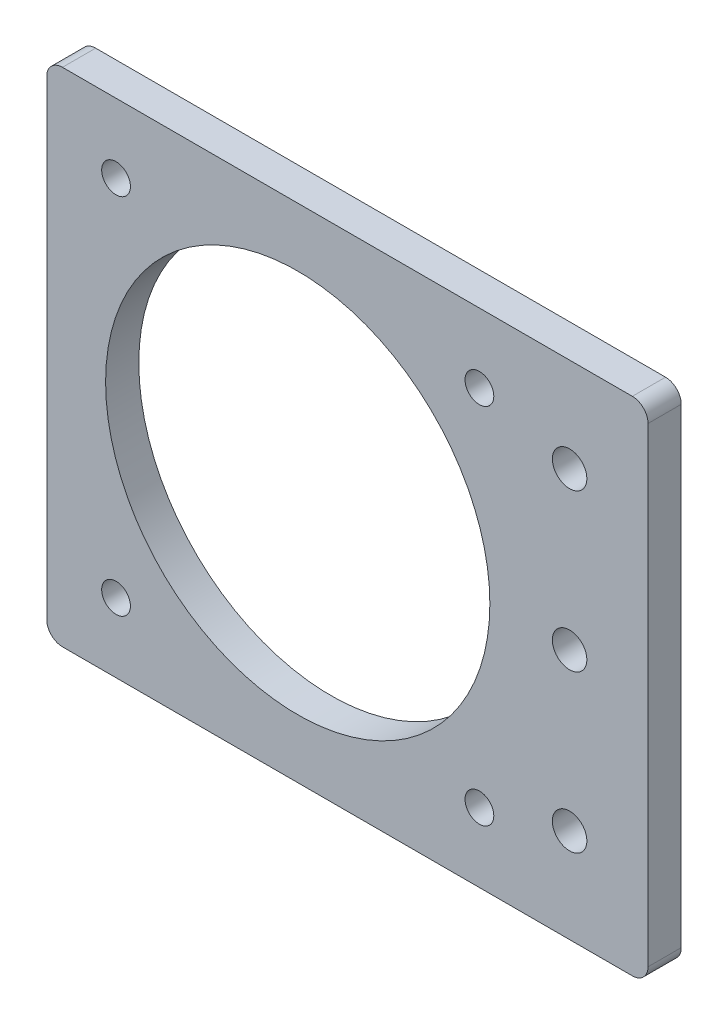
ISO-10303-21;
HEADER;
FILE_DESCRIPTION(('STEP AP214'),'2;1');
FILE_NAME('part.step','',(''),(''),'','','');
FILE_SCHEMA(('AUTOMOTIVE_DESIGN { 1 0 10303 214 1 1 1 1 }'));
ENDSEC;
DATA;
#1=APPLICATION_CONTEXT('core data for automotive mechanical design processes');
#2=APPLICATION_PROTOCOL_DEFINITION('international standard','automotive_design',2000,#1);
#3=PRODUCT_CONTEXT('',#1,'mechanical');
#4=PRODUCT('Part','Part','',(#3));
#5=PRODUCT_RELATED_PRODUCT_CATEGORY('part','',(#4));
#6=PRODUCT_DEFINITION_FORMATION('','',#4);
#7=PRODUCT_DEFINITION_CONTEXT('part definition',#1,'design');
#8=PRODUCT_DEFINITION('design','',#6,#7);
#9=PRODUCT_DEFINITION_SHAPE('','',#8);
#10=(LENGTH_UNIT() NAMED_UNIT(*) SI_UNIT(.MILLI.,.METRE.));
#11=(NAMED_UNIT(*) PLANE_ANGLE_UNIT() SI_UNIT($,.RADIAN.));
#12=(NAMED_UNIT(*) SI_UNIT($,.STERADIAN.) SOLID_ANGLE_UNIT());
#13=UNCERTAINTY_MEASURE_WITH_UNIT(LENGTH_MEASURE(1.E-05),#10,'distance_accuracy_value','');
#14=(GEOMETRIC_REPRESENTATION_CONTEXT(3) GLOBAL_UNCERTAINTY_ASSIGNED_CONTEXT((#13)) GLOBAL_UNIT_ASSIGNED_CONTEXT((#10,
#11,#12)) REPRESENTATION_CONTEXT('',''));
#15=CARTESIAN_POINT('',(0.,0.,0.));
#16=DIRECTION('',(0.,0.,1.));
#17=DIRECTION('',(1.,0.,0.));
#18=AXIS2_PLACEMENT_3D('',#15,#16,#17);
#19=CARTESIAN_POINT('',(57.5,-48.,6.35));
#20=DIRECTION('',(-1.,0.,0.));
#21=DIRECTION('',(0.,0.,1.));
#22=AXIS2_PLACEMENT_3D('',#19,#20,#21);
#23=PLANE('',#22);
#24=DIRECTION('',(0.,1.,0.));
#25=VECTOR('',#24,1.);
#26=CARTESIAN_POINT('',(57.5,-48.,6.35));
#27=LINE('',#26,#25);
#28=CARTESIAN_POINT('',(57.5,-45.,6.35));
#29=VERTEX_POINT('',#28);
#30=CARTESIAN_POINT('',(57.5,45.,6.35));
#31=VERTEX_POINT('',#30);
#32=EDGE_CURVE('E121',#29,#31,#27,.T.);
#33=ORIENTED_EDGE('',*,*,#32,.F.);
#34=DIRECTION('',(0.,0.,-1.));
#35=VECTOR('',#34,1.);
#36=CARTESIAN_POINT('',(57.5,-45.,6.35));
#37=LINE('',#36,#35);
#38=CARTESIAN_POINT('',(57.5,-45.,0.));
#39=VERTEX_POINT('',#38);
#40=EDGE_CURVE('E106',#29,#39,#37,.T.);
#41=ORIENTED_EDGE('',*,*,#40,.T.);
#42=DIRECTION('',(0.,1.,0.));
#43=VECTOR('',#42,1.);
#44=CARTESIAN_POINT('',(57.5,-48.,0.));
#45=LINE('',#44,#43);
#46=CARTESIAN_POINT('',(57.5,45.,0.));
#47=VERTEX_POINT('',#46);
#48=EDGE_CURVE('E118',#39,#47,#45,.T.);
#49=ORIENTED_EDGE('',*,*,#48,.T.);
#50=DIRECTION('',(0.,0.,-1.));
#51=VECTOR('',#50,1.);
#52=CARTESIAN_POINT('',(57.5,45.,6.35));
#53=LINE('',#52,#51);
#54=EDGE_CURVE('E123',#47,#31,#53,.F.);
#55=ORIENTED_EDGE('',*,*,#54,.T.);
#56=EDGE_LOOP('',(#33,#41,#49,#55));
#57=FACE_BOUND('',#56,.T.);
#58=ADVANCED_FACE('F33',(#57),#23,.F.);
#59=CARTESIAN_POINT('',(-57.5,48.,6.35));
#60=DIRECTION('',(0.,-1.,0.));
#61=DIRECTION('',(0.,0.,-1.));
#62=AXIS2_PLACEMENT_3D('',#59,#60,#61);
#63=PLANE('',#62);
#64=DIRECTION('',(-1.,0.,0.));
#65=VECTOR('',#64,1.);
#66=CARTESIAN_POINT('',(-57.5,48.,6.35));
#67=LINE('',#66,#65);
#68=CARTESIAN_POINT('',(54.5,48.,6.35));
#69=VERTEX_POINT('',#68);
#70=CARTESIAN_POINT('',(-54.5,48.,6.35));
#71=VERTEX_POINT('',#70);
#72=EDGE_CURVE('E185',#69,#71,#67,.T.);
#73=ORIENTED_EDGE('',*,*,#72,.F.);
#74=DIRECTION('',(0.,0.,-1.));
#75=VECTOR('',#74,1.);
#76=CARTESIAN_POINT('',(54.5,48.,6.35));
#77=LINE('',#76,#75);
#78=CARTESIAN_POINT('',(54.5,48.,0.));
#79=VERTEX_POINT('',#78);
#80=EDGE_CURVE('E11',#69,#79,#77,.T.);
#81=ORIENTED_EDGE('',*,*,#80,.T.);
#82=DIRECTION('',(-1.,0.,0.));
#83=VECTOR('',#82,1.);
#84=CARTESIAN_POINT('',(-57.5,48.,0.));
#85=LINE('',#84,#83);
#86=CARTESIAN_POINT('',(-54.5,48.,0.));
#87=VERTEX_POINT('',#86);
#88=EDGE_CURVE('E128',#79,#87,#85,.T.);
#89=ORIENTED_EDGE('',*,*,#88,.T.);
#90=DIRECTION('',(0.,0.,-1.));
#91=VECTOR('',#90,1.);
#92=CARTESIAN_POINT('',(-54.5,48.,6.35));
#93=LINE('',#92,#91);
#94=EDGE_CURVE('E42',#87,#71,#93,.F.);
#95=ORIENTED_EDGE('',*,*,#94,.T.);
#96=EDGE_LOOP('',(#73,#81,#89,#95));
#97=FACE_BOUND('',#96,.T.);
#98=ADVANCED_FACE('F203',(#97),#63,.F.);
#99=CARTESIAN_POINT('',(-57.5,-48.,6.35));
#100=DIRECTION('',(1.,0.,0.));
#101=DIRECTION('',(0.,0.,-1.));
#102=AXIS2_PLACEMENT_3D('',#99,#100,#101);
#103=PLANE('',#102);
#104=DIRECTION('',(0.,-1.,0.));
#105=VECTOR('',#104,1.);
#106=CARTESIAN_POINT('',(-57.5,-48.,0.));
#107=LINE('',#106,#105);
#108=CARTESIAN_POINT('',(-57.5,45.,0.));
#109=VERTEX_POINT('',#108);
#110=CARTESIAN_POINT('',(-57.5,-45.,0.));
#111=VERTEX_POINT('',#110);
#112=EDGE_CURVE('E132',#109,#111,#107,.T.);
#113=ORIENTED_EDGE('',*,*,#112,.T.);
#114=DIRECTION('',(0.,0.,-1.));
#115=VECTOR('',#114,1.);
#116=CARTESIAN_POINT('',(-57.5,-45.,6.35));
#117=LINE('',#116,#115);
#118=CARTESIAN_POINT('',(-57.5,-45.,6.35));
#119=VERTEX_POINT('',#118);
#120=EDGE_CURVE('E50',#111,#119,#117,.F.);
#121=ORIENTED_EDGE('',*,*,#120,.T.);
#122=DIRECTION('',(0.,-1.,0.));
#123=VECTOR('',#122,1.);
#124=CARTESIAN_POINT('',(-57.5,-48.,6.35));
#125=LINE('',#124,#123);
#126=CARTESIAN_POINT('',(-57.5,45.,6.35));
#127=VERTEX_POINT('',#126);
#128=EDGE_CURVE('E186',#127,#119,#125,.T.);
#129=ORIENTED_EDGE('',*,*,#128,.F.);
#130=DIRECTION('',(0.,0.,-1.));
#131=VECTOR('',#130,1.);
#132=CARTESIAN_POINT('',(-57.5,45.,6.35));
#133=LINE('',#132,#131);
#134=EDGE_CURVE('E158',#127,#109,#133,.T.);
#135=ORIENTED_EDGE('',*,*,#134,.T.);
#136=EDGE_LOOP('',(#113,#121,#129,#135));
#137=FACE_BOUND('',#136,.T.);
#138=ADVANCED_FACE('F197',(#137),#103,.F.);
#139=CARTESIAN_POINT('',(-57.5,-48.,6.35));
#140=DIRECTION('',(0.,1.,0.));
#141=DIRECTION('',(0.,0.,1.));
#142=AXIS2_PLACEMENT_3D('',#139,#140,#141);
#143=PLANE('',#142);
#144=DIRECTION('',(1.,0.,0.));
#145=VECTOR('',#144,1.);
#146=CARTESIAN_POINT('',(-57.5,-48.,0.));
#147=LINE('',#146,#145);
#148=CARTESIAN_POINT('',(-54.5,-48.,0.));
#149=VERTEX_POINT('',#148);
#150=CARTESIAN_POINT('',(54.5,-48.,0.));
#151=VERTEX_POINT('',#150);
#152=EDGE_CURVE('E142',#149,#151,#147,.T.);
#153=ORIENTED_EDGE('',*,*,#152,.T.);
#154=DIRECTION('',(0.,0.,-1.));
#155=VECTOR('',#154,1.);
#156=CARTESIAN_POINT('',(54.5,-48.,6.35));
#157=LINE('',#156,#155);
#158=CARTESIAN_POINT('',(54.5,-48.,6.35));
#159=VERTEX_POINT('',#158);
#160=EDGE_CURVE('E107',#151,#159,#157,.F.);
#161=ORIENTED_EDGE('',*,*,#160,.T.);
#162=DIRECTION('',(1.,0.,0.));
#163=VECTOR('',#162,1.);
#164=CARTESIAN_POINT('',(-57.5,-48.,6.35));
#165=LINE('',#164,#163);
#166=CARTESIAN_POINT('',(-54.5,-48.,6.35));
#167=VERTEX_POINT('',#166);
#168=EDGE_CURVE('E138',#167,#159,#165,.T.);
#169=ORIENTED_EDGE('',*,*,#168,.F.);
#170=DIRECTION('',(0.,0.,-1.));
#171=VECTOR('',#170,1.);
#172=CARTESIAN_POINT('',(-54.5,-48.,6.35));
#173=LINE('',#172,#171);
#174=EDGE_CURVE('E112',#167,#149,#173,.T.);
#175=ORIENTED_EDGE('',*,*,#174,.T.);
#176=EDGE_LOOP('',(#153,#161,#169,#175));
#177=FACE_BOUND('',#176,.T.);
#178=ADVANCED_FACE('F193',(#177),#143,.F.);
#179=CARTESIAN_POINT('',(0.,0.,6.35));
#180=DIRECTION('',(0.,0.,-1.));
#181=DIRECTION('',(-1.,0.,0.));
#182=AXIS2_PLACEMENT_3D('',#179,#180,#181);
#183=PLANE('',#182);
#184=CARTESIAN_POINT('',(25.25,-34.75,6.35));
#185=DIRECTION('',(0.,0.,1.));
#186=DIRECTION('',(1.,0.,0.));
#187=AXIS2_PLACEMENT_3D('',#184,#185,#186);
#188=CIRCLE('',#187,2.75);
#189=CARTESIAN_POINT('',(28.,-34.75,6.35));
#190=VERTEX_POINT('',#189);
#191=EDGE_CURVE('E407',#190,#190,#188,.T.);
#192=ORIENTED_EDGE('',*,*,#191,.F.);
#193=EDGE_LOOP('',(#192));
#194=FACE_BOUND('',#193,.T.);
#195=CARTESIAN_POINT('',(-44.25,-34.75,6.35));
#196=DIRECTION('',(0.,0.,1.));
#197=DIRECTION('',(1.,0.,0.));
#198=AXIS2_PLACEMENT_3D('',#195,#196,#197);
#199=CIRCLE('',#198,2.75);
#200=CARTESIAN_POINT('',(-41.5,-34.75,6.35));
#201=VERTEX_POINT('',#200);
#202=EDGE_CURVE('E401',#201,#201,#199,.T.);
#203=ORIENTED_EDGE('',*,*,#202,.F.);
#204=EDGE_LOOP('',(#203));
#205=FACE_BOUND('',#204,.T.);
#206=CARTESIAN_POINT('',(-44.25,34.75,6.35));
#207=DIRECTION('',(0.,0.,1.));
#208=DIRECTION('',(1.,0.,0.));
#209=AXIS2_PLACEMENT_3D('',#206,#207,#208);
#210=CIRCLE('',#209,2.75);
#211=CARTESIAN_POINT('',(-41.5,34.75,6.35));
#212=VERTEX_POINT('',#211);
#213=EDGE_CURVE('E395',#212,#212,#210,.T.);
#214=ORIENTED_EDGE('',*,*,#213,.F.);
#215=EDGE_LOOP('',(#214));
#216=FACE_BOUND('',#215,.T.);
#217=CARTESIAN_POINT('',(25.25,34.75,6.35));
#218=DIRECTION('',(0.,0.,1.));
#219=DIRECTION('',(1.,0.,0.));
#220=AXIS2_PLACEMENT_3D('',#217,#218,#219);
#221=CIRCLE('',#220,2.75);
#222=CARTESIAN_POINT('',(28.,34.75,6.35));
#223=VERTEX_POINT('',#222);
#224=EDGE_CURVE('E386',#223,#223,#221,.T.);
#225=ORIENTED_EDGE('',*,*,#224,.F.);
#226=EDGE_LOOP('',(#225));
#227=FACE_BOUND('',#226,.T.);
#228=CARTESIAN_POINT('',(42.5,30.,6.35));
#229=DIRECTION('',(0.,0.,1.));
#230=DIRECTION('',(1.,0.,0.));
#231=AXIS2_PLACEMENT_3D('',#228,#229,#230);
#232=CIRCLE('',#231,3.3);
#233=CARTESIAN_POINT('',(45.8,30.,6.35));
#234=VERTEX_POINT('',#233);
#235=EDGE_CURVE('E178',#234,#234,#232,.T.);
#236=ORIENTED_EDGE('',*,*,#235,.F.);
#237=EDGE_LOOP('',(#236));
#238=FACE_BOUND('',#237,.T.);
#239=CARTESIAN_POINT('',(42.5,0.,6.35));
#240=DIRECTION('',(0.,0.,1.));
#241=DIRECTION('',(1.,0.,0.));
#242=AXIS2_PLACEMENT_3D('',#239,#240,#241);
#243=CIRCLE('',#242,3.3);
#244=CARTESIAN_POINT('',(45.8,0.,6.35));
#245=VERTEX_POINT('',#244);
#246=EDGE_CURVE('E168',#245,#245,#243,.T.);
#247=ORIENTED_EDGE('',*,*,#246,.F.);
#248=EDGE_LOOP('',(#247));
#249=FACE_BOUND('',#248,.T.);
#250=CARTESIAN_POINT('',(42.5,-30.,6.35));
#251=DIRECTION('',(0.,0.,1.));
#252=DIRECTION('',(1.,0.,0.));
#253=AXIS2_PLACEMENT_3D('',#250,#251,#252);
#254=CIRCLE('',#253,3.3);
#255=CARTESIAN_POINT('',(45.8,-30.,6.35));
#256=VERTEX_POINT('',#255);
#257=EDGE_CURVE('E165',#256,#256,#254,.T.);
#258=ORIENTED_EDGE('',*,*,#257,.F.);
#259=EDGE_LOOP('',(#258));
#260=FACE_BOUND('',#259,.T.);
#261=CARTESIAN_POINT('',(-9.5,0.,6.35));
#262=DIRECTION('',(0.,0.,1.));
#263=DIRECTION('',(1.,0.,0.));
#264=AXIS2_PLACEMENT_3D('',#261,#262,#263);
#265=CIRCLE('',#264,36.75);
#266=CARTESIAN_POINT('',(27.25,0.,6.35));
#267=VERTEX_POINT('',#266);
#268=EDGE_CURVE('E135',#267,#267,#265,.T.);
#269=ORIENTED_EDGE('',*,*,#268,.F.);
#270=EDGE_LOOP('',(#269));
#271=FACE_BOUND('',#270,.T.);
#272=ORIENTED_EDGE('',*,*,#168,.T.);
#273=CARTESIAN_POINT('',(54.5,-45.,6.35));
#274=DIRECTION('',(0.,0.,-1.));
#275=DIRECTION('',(-1.,0.,0.));
#276=AXIS2_PLACEMENT_3D('',#273,#274,#275);
#277=CIRCLE('',#276,3.);
#278=EDGE_CURVE('E156',#159,#29,#277,.F.);
#279=ORIENTED_EDGE('',*,*,#278,.T.);
#280=ORIENTED_EDGE('',*,*,#32,.T.);
#281=CARTESIAN_POINT('',(54.5,45.,6.35));
#282=DIRECTION('',(0.,0.,-1.));
#283=DIRECTION('',(-1.,0.,0.));
#284=AXIS2_PLACEMENT_3D('',#281,#282,#283);
#285=CIRCLE('',#284,3.);
#286=EDGE_CURVE('E152',#31,#69,#285,.F.);
#287=ORIENTED_EDGE('',*,*,#286,.T.);
#288=ORIENTED_EDGE('',*,*,#72,.T.);
#289=CARTESIAN_POINT('',(-54.5,45.,6.35));
#290=DIRECTION('',(0.,0.,-1.));
#291=DIRECTION('',(-1.,0.,0.));
#292=AXIS2_PLACEMENT_3D('',#289,#290,#291);
#293=CIRCLE('',#292,3.);
#294=EDGE_CURVE('E57',#71,#127,#293,.F.);
#295=ORIENTED_EDGE('',*,*,#294,.T.);
#296=ORIENTED_EDGE('',*,*,#128,.T.);
#297=CARTESIAN_POINT('',(-54.5,-45.,6.35));
#298=DIRECTION('',(0.,0.,-1.));
#299=DIRECTION('',(-1.,0.,0.));
#300=AXIS2_PLACEMENT_3D('',#297,#298,#299);
#301=CIRCLE('',#300,3.);
#302=EDGE_CURVE('E154',#119,#167,#301,.F.);
#303=ORIENTED_EDGE('',*,*,#302,.T.);
#304=EDGE_LOOP('',(#272,#279,#280,#287,#288,#295,#296,#303));
#305=FACE_BOUND('',#304,.T.);
#306=ADVANCED_FACE('F190',(#194,#205,#216,#227,#238,#249,#260,#271,#305),#183,.F.);
#307=CARTESIAN_POINT('',(0.,0.,0.));
#308=DIRECTION('',(0.,0.,-1.));
#309=DIRECTION('',(-1.,0.,0.));
#310=AXIS2_PLACEMENT_3D('',#307,#308,#309);
#311=PLANE('',#310);
#312=CARTESIAN_POINT('',(25.25,-34.75,0.));
#313=DIRECTION('',(0.,0.,1.));
#314=DIRECTION('',(1.,0.,0.));
#315=AXIS2_PLACEMENT_3D('',#312,#313,#314);
#316=CIRCLE('',#315,2.75);
#317=CARTESIAN_POINT('',(28.,-34.75,0.));
#318=VERTEX_POINT('',#317);
#319=EDGE_CURVE('E404',#318,#318,#316,.T.);
#320=ORIENTED_EDGE('',*,*,#319,.T.);
#321=EDGE_LOOP('',(#320));
#322=FACE_BOUND('',#321,.T.);
#323=CARTESIAN_POINT('',(-44.25,-34.75,0.));
#324=DIRECTION('',(0.,0.,1.));
#325=DIRECTION('',(1.,0.,0.));
#326=AXIS2_PLACEMENT_3D('',#323,#324,#325);
#327=CIRCLE('',#326,2.75);
#328=CARTESIAN_POINT('',(-41.5,-34.75,0.));
#329=VERTEX_POINT('',#328);
#330=EDGE_CURVE('E398',#329,#329,#327,.T.);
#331=ORIENTED_EDGE('',*,*,#330,.T.);
#332=EDGE_LOOP('',(#331));
#333=FACE_BOUND('',#332,.T.);
#334=CARTESIAN_POINT('',(-44.25,34.75,0.));
#335=DIRECTION('',(0.,0.,1.));
#336=DIRECTION('',(1.,0.,0.));
#337=AXIS2_PLACEMENT_3D('',#334,#335,#336);
#338=CIRCLE('',#337,2.75);
#339=CARTESIAN_POINT('',(-41.5,34.75,0.));
#340=VERTEX_POINT('',#339);
#341=EDGE_CURVE('E390',#340,#340,#338,.T.);
#342=ORIENTED_EDGE('',*,*,#341,.T.);
#343=EDGE_LOOP('',(#342));
#344=FACE_BOUND('',#343,.T.);
#345=CARTESIAN_POINT('',(25.25,34.75,0.));
#346=DIRECTION('',(0.,0.,1.));
#347=DIRECTION('',(1.,0.,0.));
#348=AXIS2_PLACEMENT_3D('',#345,#346,#347);
#349=CIRCLE('',#348,2.75);
#350=CARTESIAN_POINT('',(28.,34.75,0.));
#351=VERTEX_POINT('',#350);
#352=EDGE_CURVE('E384',#351,#351,#349,.T.);
#353=ORIENTED_EDGE('',*,*,#352,.T.);
#354=EDGE_LOOP('',(#353));
#355=FACE_BOUND('',#354,.T.);
#356=CARTESIAN_POINT('',(42.5,30.,0.));
#357=DIRECTION('',(0.,0.,-1.));
#358=DIRECTION('',(-1.,0.,0.));
#359=AXIS2_PLACEMENT_3D('',#356,#357,#358);
#360=CIRCLE('',#359,3.3);
#361=CARTESIAN_POINT('',(39.2,30.,0.));
#362=VERTEX_POINT('',#361);
#363=EDGE_CURVE('E37',#362,#362,#360,.T.);
#364=ORIENTED_EDGE('',*,*,#363,.F.);
#365=EDGE_LOOP('',(#364));
#366=FACE_BOUND('',#365,.T.);
#367=CARTESIAN_POINT('',(42.5,0.,0.));
#368=DIRECTION('',(0.,0.,-1.));
#369=DIRECTION('',(-1.,0.,0.));
#370=AXIS2_PLACEMENT_3D('',#367,#368,#369);
#371=CIRCLE('',#370,3.3);
#372=CARTESIAN_POINT('',(39.2,0.,0.));
#373=VERTEX_POINT('',#372);
#374=EDGE_CURVE('E166',#373,#373,#371,.T.);
#375=ORIENTED_EDGE('',*,*,#374,.F.);
#376=EDGE_LOOP('',(#375));
#377=FACE_BOUND('',#376,.T.);
#378=CARTESIAN_POINT('',(42.5,-30.,0.));
#379=DIRECTION('',(0.,0.,-1.));
#380=DIRECTION('',(-1.,0.,0.));
#381=AXIS2_PLACEMENT_3D('',#378,#379,#380);
#382=CIRCLE('',#381,3.3);
#383=CARTESIAN_POINT('',(39.2,-30.,0.));
#384=VERTEX_POINT('',#383);
#385=EDGE_CURVE('E163',#384,#384,#382,.T.);
#386=ORIENTED_EDGE('',*,*,#385,.F.);
#387=EDGE_LOOP('',(#386));
#388=FACE_BOUND('',#387,.T.);
#389=CARTESIAN_POINT('',(-9.5,0.,0.));
#390=DIRECTION('',(0.,0.,1.));
#391=DIRECTION('',(1.,0.,0.));
#392=AXIS2_PLACEMENT_3D('',#389,#390,#391);
#393=CIRCLE('',#392,36.75);
#394=CARTESIAN_POINT('',(27.25,0.,0.));
#395=VERTEX_POINT('',#394);
#396=EDGE_CURVE('E129',#395,#395,#393,.T.);
#397=ORIENTED_EDGE('',*,*,#396,.T.);
#398=EDGE_LOOP('',(#397));
#399=FACE_BOUND('',#398,.T.);
#400=ORIENTED_EDGE('',*,*,#48,.F.);
#401=CARTESIAN_POINT('',(54.5,-45.,0.));
#402=DIRECTION('',(0.,0.,-1.));
#403=DIRECTION('',(-1.,0.,0.));
#404=AXIS2_PLACEMENT_3D('',#401,#402,#403);
#405=CIRCLE('',#404,3.);
#406=EDGE_CURVE('E102',#39,#151,#405,.T.);
#407=ORIENTED_EDGE('',*,*,#406,.T.);
#408=ORIENTED_EDGE('',*,*,#152,.F.);
#409=CARTESIAN_POINT('',(-54.5,-45.,0.));
#410=DIRECTION('',(0.,0.,-1.));
#411=DIRECTION('',(-1.,0.,0.));
#412=AXIS2_PLACEMENT_3D('',#409,#410,#411);
#413=CIRCLE('',#412,3.);
#414=EDGE_CURVE('E113',#149,#111,#413,.T.);
#415=ORIENTED_EDGE('',*,*,#414,.T.);
#416=ORIENTED_EDGE('',*,*,#112,.F.);
#417=CARTESIAN_POINT('',(-54.5,45.,0.));
#418=DIRECTION('',(0.,0.,-1.));
#419=DIRECTION('',(-1.,0.,0.));
#420=AXIS2_PLACEMENT_3D('',#417,#418,#419);
#421=CIRCLE('',#420,3.);
#422=EDGE_CURVE('E122',#109,#87,#421,.T.);
#423=ORIENTED_EDGE('',*,*,#422,.T.);
#424=ORIENTED_EDGE('',*,*,#88,.F.);
#425=CARTESIAN_POINT('',(54.5,45.,0.));
#426=DIRECTION('',(0.,0.,-1.));
#427=DIRECTION('',(-1.,0.,0.));
#428=AXIS2_PLACEMENT_3D('',#425,#426,#427);
#429=CIRCLE('',#428,3.);
#430=EDGE_CURVE('E127',#79,#47,#429,.T.);
#431=ORIENTED_EDGE('',*,*,#430,.T.);
#432=EDGE_LOOP('',(#400,#407,#408,#415,#416,#423,#424,#431));
#433=FACE_BOUND('',#432,.T.);
#434=ADVANCED_FACE('F125',(#322,#333,#344,#355,#366,#377,#388,#399,#433),#311,.T.);
#435=CARTESIAN_POINT('',(-9.5,0.,0.));
#436=DIRECTION('',(0.,0.,1.));
#437=DIRECTION('',(1.,0.,0.));
#438=AXIS2_PLACEMENT_3D('',#435,#436,#437);
#439=CYLINDRICAL_SURFACE('',#438,36.75);
#440=ORIENTED_EDGE('',*,*,#396,.F.);
#441=EDGE_LOOP('',(#440));
#442=FACE_BOUND('',#441,.T.);
#443=ORIENTED_EDGE('',*,*,#268,.T.);
#444=EDGE_LOOP('',(#443));
#445=FACE_BOUND('',#444,.T.);
#446=ADVANCED_FACE('F224',(#442,#445),#439,.F.);
#447=CARTESIAN_POINT('',(54.5,-45.,6.35));
#448=DIRECTION('',(0.,0.,-1.));
#449=DIRECTION('',(-1.,0.,0.));
#450=AXIS2_PLACEMENT_3D('',#447,#448,#449);
#451=CYLINDRICAL_SURFACE('',#450,3.);
#452=ORIENTED_EDGE('',*,*,#278,.F.);
#453=ORIENTED_EDGE('',*,*,#160,.F.);
#454=ORIENTED_EDGE('',*,*,#406,.F.);
#455=ORIENTED_EDGE('',*,*,#40,.F.);
#456=EDGE_LOOP('',(#452,#453,#454,#455));
#457=FACE_BOUND('',#456,.T.);
#458=ADVANCED_FACE('F105',(#457),#451,.T.);
#459=CARTESIAN_POINT('',(-54.5,-45.,6.35));
#460=DIRECTION('',(0.,0.,-1.));
#461=DIRECTION('',(-1.,0.,0.));
#462=AXIS2_PLACEMENT_3D('',#459,#460,#461);
#463=CYLINDRICAL_SURFACE('',#462,3.);
#464=ORIENTED_EDGE('',*,*,#302,.F.);
#465=ORIENTED_EDGE('',*,*,#120,.F.);
#466=ORIENTED_EDGE('',*,*,#414,.F.);
#467=ORIENTED_EDGE('',*,*,#174,.F.);
#468=EDGE_LOOP('',(#464,#465,#466,#467));
#469=FACE_BOUND('',#468,.T.);
#470=ADVANCED_FACE('F195',(#469),#463,.T.);
#471=CARTESIAN_POINT('',(54.5,45.,6.35));
#472=DIRECTION('',(0.,0.,-1.));
#473=DIRECTION('',(-1.,0.,0.));
#474=AXIS2_PLACEMENT_3D('',#471,#472,#473);
#475=CYLINDRICAL_SURFACE('',#474,3.);
#476=ORIENTED_EDGE('',*,*,#286,.F.);
#477=ORIENTED_EDGE('',*,*,#54,.F.);
#478=ORIENTED_EDGE('',*,*,#430,.F.);
#479=ORIENTED_EDGE('',*,*,#80,.F.);
#480=EDGE_LOOP('',(#476,#477,#478,#479));
#481=FACE_BOUND('',#480,.T.);
#482=ADVANCED_FACE('F207',(#481),#475,.T.);
#483=CARTESIAN_POINT('',(-54.5,45.,6.35));
#484=DIRECTION('',(0.,0.,-1.));
#485=DIRECTION('',(-1.,0.,0.));
#486=AXIS2_PLACEMENT_3D('',#483,#484,#485);
#487=CYLINDRICAL_SURFACE('',#486,3.);
#488=ORIENTED_EDGE('',*,*,#294,.F.);
#489=ORIENTED_EDGE('',*,*,#94,.F.);
#490=ORIENTED_EDGE('',*,*,#422,.F.);
#491=ORIENTED_EDGE('',*,*,#134,.F.);
#492=EDGE_LOOP('',(#488,#489,#490,#491));
#493=FACE_BOUND('',#492,.T.);
#494=ADVANCED_FACE('F35',(#493),#487,.T.);
#495=CARTESIAN_POINT('',(42.5,-30.,6.35));
#496=DIRECTION('',(0.,0.,1.));
#497=DIRECTION('',(1.,0.,0.));
#498=AXIS2_PLACEMENT_3D('',#495,#496,#497);
#499=CYLINDRICAL_SURFACE('',#498,3.3);
#500=ORIENTED_EDGE('',*,*,#385,.T.);
#501=EDGE_LOOP('',(#500));
#502=FACE_BOUND('',#501,.T.);
#503=ORIENTED_EDGE('',*,*,#257,.T.);
#504=EDGE_LOOP('',(#503));
#505=FACE_BOUND('',#504,.T.);
#506=ADVANCED_FACE('F213',(#502,#505),#499,.F.);
#507=CARTESIAN_POINT('',(42.5,0.,6.35));
#508=DIRECTION('',(0.,0.,1.));
#509=DIRECTION('',(1.,0.,0.));
#510=AXIS2_PLACEMENT_3D('',#507,#508,#509);
#511=CYLINDRICAL_SURFACE('',#510,3.3);
#512=ORIENTED_EDGE('',*,*,#374,.T.);
#513=EDGE_LOOP('',(#512));
#514=FACE_BOUND('',#513,.T.);
#515=ORIENTED_EDGE('',*,*,#246,.T.);
#516=EDGE_LOOP('',(#515));
#517=FACE_BOUND('',#516,.T.);
#518=ADVANCED_FACE('F313',(#514,#517),#511,.F.);
#519=CARTESIAN_POINT('',(42.5,30.,6.35));
#520=DIRECTION('',(0.,0.,1.));
#521=DIRECTION('',(1.,0.,0.));
#522=AXIS2_PLACEMENT_3D('',#519,#520,#521);
#523=CYLINDRICAL_SURFACE('',#522,3.3);
#524=ORIENTED_EDGE('',*,*,#363,.T.);
#525=EDGE_LOOP('',(#524));
#526=FACE_BOUND('',#525,.T.);
#527=ORIENTED_EDGE('',*,*,#235,.T.);
#528=EDGE_LOOP('',(#527));
#529=FACE_BOUND('',#528,.T.);
#530=ADVANCED_FACE('F274',(#526,#529),#523,.F.);
#531=CARTESIAN_POINT('',(25.25,34.75,6.35));
#532=DIRECTION('',(0.,0.,1.));
#533=DIRECTION('',(1.,0.,0.));
#534=AXIS2_PLACEMENT_3D('',#531,#532,#533);
#535=CYLINDRICAL_SURFACE('',#534,2.75);
#536=ORIENTED_EDGE('',*,*,#352,.F.);
#537=EDGE_LOOP('',(#536));
#538=FACE_BOUND('',#537,.T.);
#539=ORIENTED_EDGE('',*,*,#224,.T.);
#540=EDGE_LOOP('',(#539));
#541=FACE_BOUND('',#540,.T.);
#542=ADVANCED_FACE('F268',(#538,#541),#535,.F.);
#543=CARTESIAN_POINT('',(-44.25,34.75,6.35));
#544=DIRECTION('',(0.,0.,1.));
#545=DIRECTION('',(1.,0.,0.));
#546=AXIS2_PLACEMENT_3D('',#543,#544,#545);
#547=CYLINDRICAL_SURFACE('',#546,2.75);
#548=ORIENTED_EDGE('',*,*,#341,.F.);
#549=EDGE_LOOP('',(#548));
#550=FACE_BOUND('',#549,.T.);
#551=ORIENTED_EDGE('',*,*,#213,.T.);
#552=EDGE_LOOP('',(#551));
#553=FACE_BOUND('',#552,.T.);
#554=ADVANCED_FACE('F273',(#550,#553),#547,.F.);
#555=CARTESIAN_POINT('',(-44.25,-34.75,6.35));
#556=DIRECTION('',(0.,0.,1.));
#557=DIRECTION('',(1.,0.,0.));
#558=AXIS2_PLACEMENT_3D('',#555,#556,#557);
#559=CYLINDRICAL_SURFACE('',#558,2.75);
#560=ORIENTED_EDGE('',*,*,#330,.F.);
#561=EDGE_LOOP('',(#560));
#562=FACE_BOUND('',#561,.T.);
#563=ORIENTED_EDGE('',*,*,#202,.T.);
#564=EDGE_LOOP('',(#563));
#565=FACE_BOUND('',#564,.T.);
#566=ADVANCED_FACE('F286',(#562,#565),#559,.F.);
#567=CARTESIAN_POINT('',(25.25,-34.75,6.35));
#568=DIRECTION('',(0.,0.,1.));
#569=DIRECTION('',(1.,0.,0.));
#570=AXIS2_PLACEMENT_3D('',#567,#568,#569);
#571=CYLINDRICAL_SURFACE('',#570,2.75);
#572=ORIENTED_EDGE('',*,*,#319,.F.);
#573=EDGE_LOOP('',(#572));
#574=FACE_BOUND('',#573,.T.);
#575=ORIENTED_EDGE('',*,*,#191,.T.);
#576=EDGE_LOOP('',(#575));
#577=FACE_BOUND('',#576,.T.);
#578=ADVANCED_FACE('F296',(#574,#577),#571,.F.);
#579=CLOSED_SHELL('',(#58,#98,#138,#178,#306,#434,#446,#458,#470,#482,#494,#506,#518,#530,#542,
#554,#566,#578));
#580=MANIFOLD_SOLID_BREP('B2',#579);
#581=ADVANCED_BREP_SHAPE_REPRESENTATION('',(#18,#580),#14);
#582=SHAPE_DEFINITION_REPRESENTATION(#9,#581);
ENDSEC;
END-ISO-10303-21;
